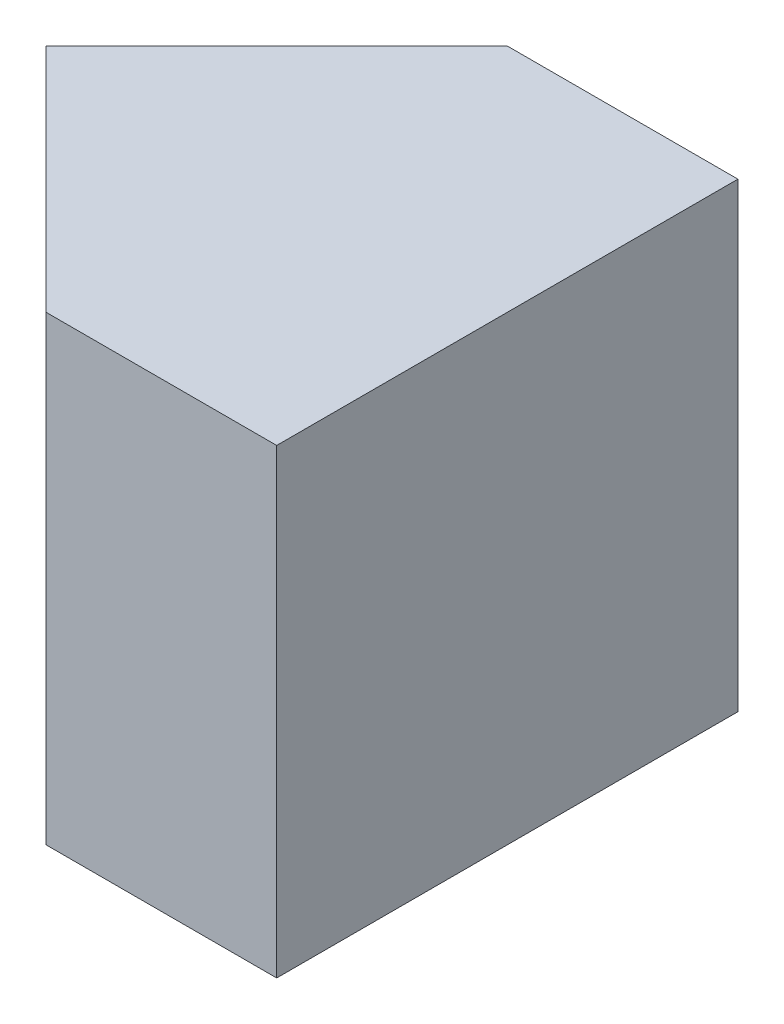
ISO-10303-21;
HEADER;
FILE_DESCRIPTION(('STEP AP214'),'2;1');
FILE_NAME('part.step','',(''),(''),'','','');
FILE_SCHEMA(('AUTOMOTIVE_DESIGN { 1 0 10303 214 1 1 1 1 }'));
ENDSEC;
DATA;
#1=APPLICATION_CONTEXT('core data for automotive mechanical design processes');
#2=APPLICATION_PROTOCOL_DEFINITION('international standard','automotive_design',2000,#1);
#3=PRODUCT_CONTEXT('',#1,'mechanical');
#4=PRODUCT('Part','Part','',(#3));
#5=PRODUCT_RELATED_PRODUCT_CATEGORY('part','',(#4));
#6=PRODUCT_DEFINITION_FORMATION('','',#4);
#7=PRODUCT_DEFINITION_CONTEXT('part definition',#1,'design');
#8=PRODUCT_DEFINITION('design','',#6,#7);
#9=PRODUCT_DEFINITION_SHAPE('','',#8);
#10=(LENGTH_UNIT() NAMED_UNIT(*) SI_UNIT(.MILLI.,.METRE.));
#11=(NAMED_UNIT(*) PLANE_ANGLE_UNIT() SI_UNIT($,.RADIAN.));
#12=(NAMED_UNIT(*) SI_UNIT($,.STERADIAN.) SOLID_ANGLE_UNIT());
#13=UNCERTAINTY_MEASURE_WITH_UNIT(LENGTH_MEASURE(1.E-05),#10,'distance_accuracy_value','');
#14=(GEOMETRIC_REPRESENTATION_CONTEXT(3) GLOBAL_UNCERTAINTY_ASSIGNED_CONTEXT((#13)) GLOBAL_UNIT_ASSIGNED_CONTEXT((#10,
#11,#12)) REPRESENTATION_CONTEXT('',''));
#15=CARTESIAN_POINT('',(0.,0.,0.));
#16=DIRECTION('',(0.,0.,1.));
#17=DIRECTION('',(1.,0.,0.));
#18=AXIS2_PLACEMENT_3D('',#15,#16,#17);
#19=CARTESIAN_POINT('',(0.,0.,20.));
#20=DIRECTION('',(0.,1.,0.));
#21=DIRECTION('',(0.,0.,1.));
#22=AXIS2_PLACEMENT_3D('',#19,#20,#21);
#23=PLANE('',#22);
#24=DIRECTION('',(1.,0.,0.));
#25=VECTOR('',#24,1.);
#26=CARTESIAN_POINT('',(0.,0.,20.));
#27=LINE('',#26,#25);
#28=CARTESIAN_POINT('',(10.,0.,20.));
#29=VERTEX_POINT('',#28);
#30=CARTESIAN_POINT('',(20.,0.,20.));
#31=VERTEX_POINT('',#30);
#32=EDGE_CURVE('E86',#29,#31,#27,.T.);
#33=ORIENTED_EDGE('',*,*,#32,.F.);
#34=DIRECTION('',(-0.707106781186548,0.,-0.707106781186548));
#35=VECTOR('',#34,1.);
#36=CARTESIAN_POINT('',(10.,0.,20.));
#37=LINE('',#36,#35);
#38=CARTESIAN_POINT('',(0.,0.,10.));
#39=VERTEX_POINT('',#38);
#40=EDGE_CURVE('E103',#29,#39,#37,.T.);
#41=ORIENTED_EDGE('',*,*,#40,.T.);
#42=DIRECTION('',(0.707106781186548,0.,-0.707106781186548));
#43=VECTOR('',#42,1.);
#44=CARTESIAN_POINT('',(10.,0.,0.));
#45=LINE('',#44,#43);
#46=CARTESIAN_POINT('',(10.,0.,0.));
#47=VERTEX_POINT('',#46);
#48=EDGE_CURVE('E95',#39,#47,#45,.T.);
#49=ORIENTED_EDGE('',*,*,#48,.T.);
#50=DIRECTION('',(1.,0.,0.));
#51=VECTOR('',#50,1.);
#52=CARTESIAN_POINT('',(0.,0.,0.));
#53=LINE('',#52,#51);
#54=CARTESIAN_POINT('',(20.,0.,0.));
#55=VERTEX_POINT('',#54);
#56=EDGE_CURVE('E77',#47,#55,#53,.T.);
#57=ORIENTED_EDGE('',*,*,#56,.T.);
#58=DIRECTION('',(0.,0.,-1.));
#59=VECTOR('',#58,1.);
#60=CARTESIAN_POINT('',(20.,0.,20.));
#61=LINE('',#60,#59);
#62=EDGE_CURVE('E11',#31,#55,#61,.T.);
#63=ORIENTED_EDGE('',*,*,#62,.F.);
#64=EDGE_LOOP('',(#33,#41,#49,#57,#63));
#65=FACE_BOUND('',#64,.T.);
#66=ADVANCED_FACE('F33',(#65),#23,.F.);
#67=CARTESIAN_POINT('',(20.,0.,20.));
#68=DIRECTION('',(-1.,0.,0.));
#69=DIRECTION('',(0.,0.,1.));
#70=AXIS2_PLACEMENT_3D('',#67,#68,#69);
#71=PLANE('',#70);
#72=DIRECTION('',(0.,1.,0.));
#73=VECTOR('',#72,1.);
#74=CARTESIAN_POINT('',(20.,0.,0.));
#75=LINE('',#74,#73);
#76=CARTESIAN_POINT('',(20.,20.,0.));
#77=VERTEX_POINT('',#76);
#78=EDGE_CURVE('E68',#55,#77,#75,.T.);
#79=ORIENTED_EDGE('',*,*,#78,.T.);
#80=DIRECTION('',(0.,0.,-1.));
#81=VECTOR('',#80,1.);
#82=CARTESIAN_POINT('',(20.,20.,20.));
#83=LINE('',#82,#81);
#84=CARTESIAN_POINT('',(20.,20.,20.));
#85=VERTEX_POINT('',#84);
#86=EDGE_CURVE('E40',#85,#77,#83,.T.);
#87=ORIENTED_EDGE('',*,*,#86,.F.);
#88=DIRECTION('',(0.,1.,0.));
#89=VECTOR('',#88,1.);
#90=CARTESIAN_POINT('',(20.,0.,20.));
#91=LINE('',#90,#89);
#92=EDGE_CURVE('E56',#31,#85,#91,.T.);
#93=ORIENTED_EDGE('',*,*,#92,.F.);
#94=ORIENTED_EDGE('',*,*,#62,.T.);
#95=EDGE_LOOP('',(#79,#87,#93,#94));
#96=FACE_BOUND('',#95,.T.);
#97=ADVANCED_FACE('F70',(#96),#71,.F.);
#98=CARTESIAN_POINT('',(0.,20.,20.));
#99=DIRECTION('',(0.,-1.,0.));
#100=DIRECTION('',(0.,0.,-1.));
#101=AXIS2_PLACEMENT_3D('',#98,#99,#100);
#102=PLANE('',#101);
#103=DIRECTION('',(0.707106781186548,0.,-0.707106781186548));
#104=VECTOR('',#103,1.);
#105=CARTESIAN_POINT('',(10.,20.,0.));
#106=LINE('',#105,#104);
#107=CARTESIAN_POINT('',(0.,20.,10.));
#108=VERTEX_POINT('',#107);
#109=CARTESIAN_POINT('',(10.,20.,0.));
#110=VERTEX_POINT('',#109);
#111=EDGE_CURVE('E47',#108,#110,#106,.T.);
#112=ORIENTED_EDGE('',*,*,#111,.F.);
#113=DIRECTION('',(-0.707106781186548,0.,-0.707106781186548));
#114=VECTOR('',#113,1.);
#115=CARTESIAN_POINT('',(10.,20.,20.));
#116=LINE('',#115,#114);
#117=CARTESIAN_POINT('',(10.,20.,20.));
#118=VERTEX_POINT('',#117);
#119=EDGE_CURVE('E104',#118,#108,#116,.T.);
#120=ORIENTED_EDGE('',*,*,#119,.F.);
#121=DIRECTION('',(-1.,0.,0.));
#122=VECTOR('',#121,1.);
#123=CARTESIAN_POINT('',(0.,20.,20.));
#124=LINE('',#123,#122);
#125=EDGE_CURVE('E83',#85,#118,#124,.T.);
#126=ORIENTED_EDGE('',*,*,#125,.F.);
#127=ORIENTED_EDGE('',*,*,#86,.T.);
#128=DIRECTION('',(-1.,0.,0.));
#129=VECTOR('',#128,1.);
#130=CARTESIAN_POINT('',(0.,20.,0.));
#131=LINE('',#130,#129);
#132=EDGE_CURVE('E76',#77,#110,#131,.T.);
#133=ORIENTED_EDGE('',*,*,#132,.T.);
#134=EDGE_LOOP('',(#112,#120,#126,#127,#133));
#135=FACE_BOUND('',#134,.T.);
#136=ADVANCED_FACE('F81',(#135),#102,.F.);
#137=CARTESIAN_POINT('',(0.,0.,20.));
#138=DIRECTION('',(0.,0.,-1.));
#139=DIRECTION('',(-1.,0.,0.));
#140=AXIS2_PLACEMENT_3D('',#137,#138,#139);
#141=PLANE('',#140);
#142=ORIENTED_EDGE('',*,*,#125,.T.);
#143=DIRECTION('',(0.,1.,0.));
#144=VECTOR('',#143,1.);
#145=CARTESIAN_POINT('',(10.,0.,20.));
#146=LINE('',#145,#144);
#147=EDGE_CURVE('E98',#29,#118,#146,.T.);
#148=ORIENTED_EDGE('',*,*,#147,.F.);
#149=ORIENTED_EDGE('',*,*,#32,.T.);
#150=ORIENTED_EDGE('',*,*,#92,.T.);
#151=EDGE_LOOP('',(#142,#148,#149,#150));
#152=FACE_BOUND('',#151,.T.);
#153=ADVANCED_FACE('F125',(#152),#141,.F.);
#154=CARTESIAN_POINT('',(0.,0.,0.));
#155=DIRECTION('',(0.,0.,-1.));
#156=DIRECTION('',(-1.,0.,0.));
#157=AXIS2_PLACEMENT_3D('',#154,#155,#156);
#158=PLANE('',#157);
#159=DIRECTION('',(0.,1.,0.));
#160=VECTOR('',#159,1.);
#161=CARTESIAN_POINT('',(10.,0.,0.));
#162=LINE('',#161,#160);
#163=EDGE_CURVE('E85',#47,#110,#162,.T.);
#164=ORIENTED_EDGE('',*,*,#163,.T.);
#165=ORIENTED_EDGE('',*,*,#132,.F.);
#166=ORIENTED_EDGE('',*,*,#78,.F.);
#167=ORIENTED_EDGE('',*,*,#56,.F.);
#168=EDGE_LOOP('',(#164,#165,#166,#167));
#169=FACE_BOUND('',#168,.T.);
#170=ADVANCED_FACE('F84',(#169),#158,.T.);
#171=CARTESIAN_POINT('',(10.,0.,0.));
#172=DIRECTION('',(0.707106781186548,0.,0.707106781186548));
#173=DIRECTION('',(0.707106781186548,0.,-0.707106781186548));
#174=AXIS2_PLACEMENT_3D('',#171,#172,#173);
#175=PLANE('',#174);
#176=ORIENTED_EDGE('',*,*,#111,.T.);
#177=ORIENTED_EDGE('',*,*,#163,.F.);
#178=ORIENTED_EDGE('',*,*,#48,.F.);
#179=DIRECTION('',(0.,1.,0.));
#180=VECTOR('',#179,1.);
#181=CARTESIAN_POINT('',(0.,0.,10.));
#182=LINE('',#181,#180);
#183=EDGE_CURVE('E93',#39,#108,#182,.T.);
#184=ORIENTED_EDGE('',*,*,#183,.T.);
#185=EDGE_LOOP('',(#176,#177,#178,#184));
#186=FACE_BOUND('',#185,.T.);
#187=ADVANCED_FACE('F119',(#186),#175,.F.);
#188=CARTESIAN_POINT('',(10.,0.,20.));
#189=DIRECTION('',(0.707106781186548,0.,-0.707106781186548));
#190=DIRECTION('',(-0.707106781186548,0.,-0.707106781186548));
#191=AXIS2_PLACEMENT_3D('',#188,#189,#190);
#192=PLANE('',#191);
#193=ORIENTED_EDGE('',*,*,#119,.T.);
#194=ORIENTED_EDGE('',*,*,#183,.F.);
#195=ORIENTED_EDGE('',*,*,#40,.F.);
#196=ORIENTED_EDGE('',*,*,#147,.T.);
#197=EDGE_LOOP('',(#193,#194,#195,#196));
#198=FACE_BOUND('',#197,.T.);
#199=ADVANCED_FACE('F124',(#198),#192,.F.);
#200=CLOSED_SHELL('',(#66,#97,#136,#153,#170,#187,#199));
#201=MANIFOLD_SOLID_BREP('B2',#200);
#202=ADVANCED_BREP_SHAPE_REPRESENTATION('',(#18,#201),#14);
#203=SHAPE_DEFINITION_REPRESENTATION(#9,#202);
ENDSEC;
END-ISO-10303-21;
